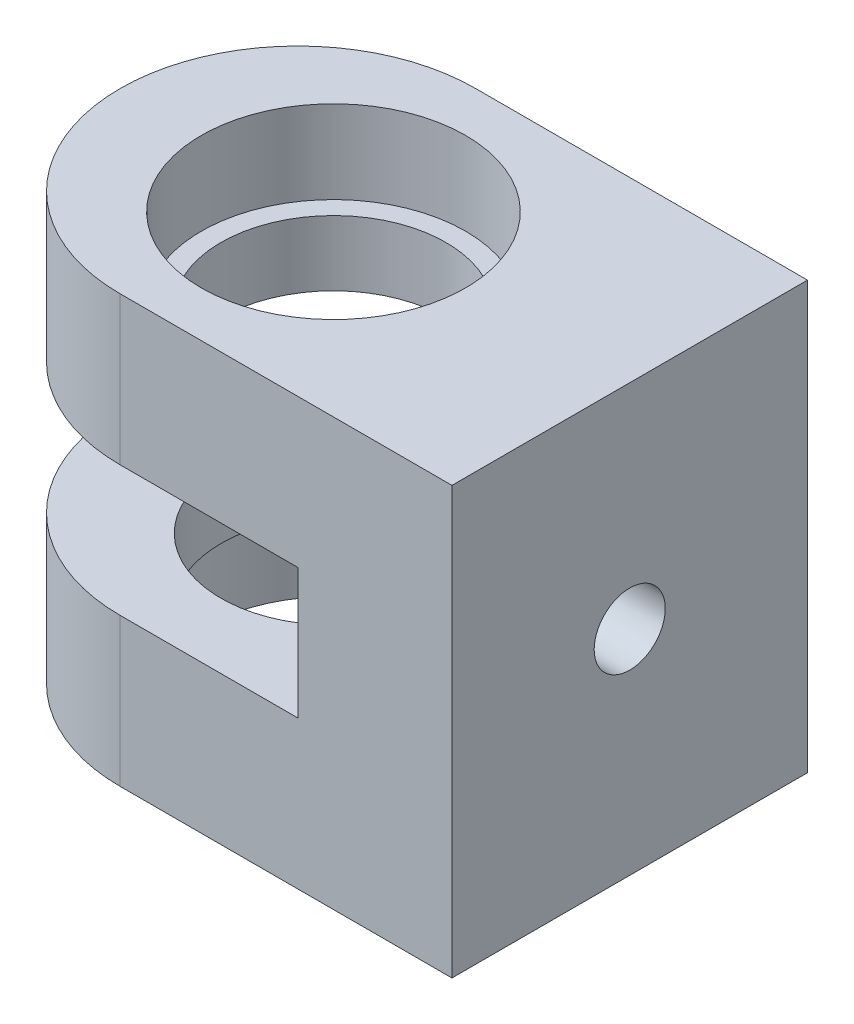
ISO-10303-21;
HEADER;
FILE_DESCRIPTION(('STEP AP214'),'2;1');
FILE_NAME('part.step','',(''),(''),'','','');
FILE_SCHEMA(('AUTOMOTIVE_DESIGN { 1 0 10303 214 1 1 1 1 }'));
ENDSEC;
DATA;
#1=APPLICATION_CONTEXT('core data for automotive mechanical design processes');
#2=APPLICATION_PROTOCOL_DEFINITION('international standard','automotive_design',2000,#1);
#3=PRODUCT_CONTEXT('',#1,'mechanical');
#4=PRODUCT('Part','Part','',(#3));
#5=PRODUCT_RELATED_PRODUCT_CATEGORY('part','',(#4));
#6=PRODUCT_DEFINITION_FORMATION('','',#4);
#7=PRODUCT_DEFINITION_CONTEXT('part definition',#1,'design');
#8=PRODUCT_DEFINITION('design','',#6,#7);
#9=PRODUCT_DEFINITION_SHAPE('','',#8);
#10=(LENGTH_UNIT() NAMED_UNIT(*) SI_UNIT(.MILLI.,.METRE.));
#11=(NAMED_UNIT(*) PLANE_ANGLE_UNIT() SI_UNIT($,.RADIAN.));
#12=(NAMED_UNIT(*) SI_UNIT($,.STERADIAN.) SOLID_ANGLE_UNIT());
#13=UNCERTAINTY_MEASURE_WITH_UNIT(LENGTH_MEASURE(1.E-05),#10,'distance_accuracy_value','');
#14=(GEOMETRIC_REPRESENTATION_CONTEXT(3) GLOBAL_UNCERTAINTY_ASSIGNED_CONTEXT((#13)) GLOBAL_UNIT_ASSIGNED_CONTEXT((#10,
#11,#12)) REPRESENTATION_CONTEXT('',''));
#15=CARTESIAN_POINT('',(0.,0.,0.));
#16=DIRECTION('',(0.,0.,1.));
#17=DIRECTION('',(1.,0.,0.));
#18=AXIS2_PLACEMENT_3D('',#15,#16,#17);
#19=CARTESIAN_POINT('',(21.5,36.,15.));
#20=DIRECTION('',(0.,0.,-1.));
#21=DIRECTION('',(-1.,0.,0.));
#22=AXIS2_PLACEMENT_3D('',#19,#20,#21);
#23=PLANE('',#22);
#24=DIRECTION('',(-1.,0.,0.));
#25=VECTOR('',#24,1.);
#26=CARTESIAN_POINT('',(8.5,12.5,15.));
#27=LINE('',#26,#25);
#28=CARTESIAN_POINT('',(8.5,12.5,15.));
#29=VERTEX_POINT('',#28);
#30=CARTESIAN_POINT('',(-6.5,12.5,15.));
#31=VERTEX_POINT('',#30);
#32=EDGE_CURVE('E251',#29,#31,#27,.T.);
#33=ORIENTED_EDGE('',*,*,#32,.T.);
#34=DIRECTION('',(0.,-1.,0.));
#35=VECTOR('',#34,1.);
#36=CARTESIAN_POINT('',(-6.5,36.,15.));
#37=LINE('',#36,#35);
#38=CARTESIAN_POINT('',(-6.5,0.,15.));
#39=VERTEX_POINT('',#38);
#40=EDGE_CURVE('E292',#31,#39,#37,.T.);
#41=ORIENTED_EDGE('',*,*,#40,.T.);
#42=DIRECTION('',(1.,0.,0.));
#43=VECTOR('',#42,1.);
#44=CARTESIAN_POINT('',(21.5,0.,15.));
#45=LINE('',#44,#43);
#46=CARTESIAN_POINT('',(21.5,0.,15.));
#47=VERTEX_POINT('',#46);
#48=EDGE_CURVE('E248',#39,#47,#45,.T.);
#49=ORIENTED_EDGE('',*,*,#48,.T.);
#50=DIRECTION('',(0.,-1.,0.));
#51=VECTOR('',#50,1.);
#52=CARTESIAN_POINT('',(21.5,36.,15.));
#53=LINE('',#52,#51);
#54=CARTESIAN_POINT('',(21.5,36.,15.));
#55=VERTEX_POINT('',#54);
#56=EDGE_CURVE('E271',#55,#47,#53,.T.);
#57=ORIENTED_EDGE('',*,*,#56,.F.);
#58=DIRECTION('',(1.,0.,0.));
#59=VECTOR('',#58,1.);
#60=CARTESIAN_POINT('',(21.5,36.,15.));
#61=LINE('',#60,#59);
#62=CARTESIAN_POINT('',(-6.5,36.,15.));
#63=VERTEX_POINT('',#62);
#64=EDGE_CURVE('E256',#63,#55,#61,.T.);
#65=ORIENTED_EDGE('',*,*,#64,.F.);
#66=DIRECTION('',(0.,-1.,0.));
#67=VECTOR('',#66,1.);
#68=CARTESIAN_POINT('',(-6.5,36.,15.));
#69=LINE('',#68,#67);
#70=CARTESIAN_POINT('',(-6.5,23.5,15.));
#71=VERTEX_POINT('',#70);
#72=EDGE_CURVE('E289',#63,#71,#69,.T.);
#73=ORIENTED_EDGE('',*,*,#72,.T.);
#74=DIRECTION('',(-1.,0.,0.));
#75=VECTOR('',#74,1.);
#76=CARTESIAN_POINT('',(8.5,23.5,15.));
#77=LINE('',#76,#75);
#78=CARTESIAN_POINT('',(8.5,23.5,15.));
#79=VERTEX_POINT('',#78);
#80=EDGE_CURVE('E249',#79,#71,#77,.T.);
#81=ORIENTED_EDGE('',*,*,#80,.F.);
#82=DIRECTION('',(0.,1.,0.));
#83=VECTOR('',#82,1.);
#84=CARTESIAN_POINT('',(8.5,12.5,15.));
#85=LINE('',#84,#83);
#86=EDGE_CURVE('E240',#29,#79,#85,.T.);
#87=ORIENTED_EDGE('',*,*,#86,.F.);
#88=EDGE_LOOP('',(#33,#41,#49,#57,#65,#73,#81,#87));
#89=FACE_BOUND('',#88,.T.);
#90=ADVANCED_FACE('F36',(#89),#23,.F.);
#91=CARTESIAN_POINT('',(21.5,36.,15.));
#92=DIRECTION('',(-1.,0.,0.));
#93=DIRECTION('',(0.,0.,1.));
#94=AXIS2_PLACEMENT_3D('',#91,#92,#93);
#95=PLANE('',#94);
#96=CARTESIAN_POINT('',(21.5,18.,0.));
#97=DIRECTION('',(-1.,0.,0.));
#98=DIRECTION('',(0.,0.,1.));
#99=AXIS2_PLACEMENT_3D('',#96,#97,#98);
#100=CIRCLE('',#99,3.);
#101=CARTESIAN_POINT('',(21.5,18.,3.));
#102=VERTEX_POINT('',#101);
#103=EDGE_CURVE('E193',#102,#102,#100,.T.);
#104=ORIENTED_EDGE('',*,*,#103,.T.);
#105=EDGE_LOOP('',(#104));
#106=FACE_BOUND('',#105,.T.);
#107=DIRECTION('',(0.,0.,-1.));
#108=VECTOR('',#107,1.);
#109=CARTESIAN_POINT('',(21.5,0.,15.));
#110=LINE('',#109,#108);
#111=CARTESIAN_POINT('',(21.5,0.,-15.));
#112=VERTEX_POINT('',#111);
#113=EDGE_CURVE('E265',#47,#112,#110,.T.);
#114=ORIENTED_EDGE('',*,*,#113,.T.);
#115=DIRECTION('',(0.,-1.,0.));
#116=VECTOR('',#115,1.);
#117=CARTESIAN_POINT('',(21.5,36.,-15.));
#118=LINE('',#117,#116);
#119=CARTESIAN_POINT('',(21.5,36.,-15.));
#120=VERTEX_POINT('',#119);
#121=EDGE_CURVE('E263',#120,#112,#118,.T.);
#122=ORIENTED_EDGE('',*,*,#121,.F.);
#123=DIRECTION('',(0.,0.,-1.));
#124=VECTOR('',#123,1.);
#125=CARTESIAN_POINT('',(21.5,36.,15.));
#126=LINE('',#125,#124);
#127=EDGE_CURVE('E258',#55,#120,#126,.T.);
#128=ORIENTED_EDGE('',*,*,#127,.F.);
#129=ORIENTED_EDGE('',*,*,#56,.T.);
#130=EDGE_LOOP('',(#114,#122,#128,#129));
#131=FACE_BOUND('',#130,.T.);
#132=ADVANCED_FACE('F329',(#106,#131),#95,.F.);
#133=CARTESIAN_POINT('',(21.5,36.,-15.));
#134=DIRECTION('',(0.,0.,1.));
#135=DIRECTION('',(1.,0.,0.));
#136=AXIS2_PLACEMENT_3D('',#133,#134,#135);
#137=PLANE('',#136);
#138=DIRECTION('',(-1.,0.,0.));
#139=VECTOR('',#138,1.);
#140=CARTESIAN_POINT('',(21.5,0.,-15.));
#141=LINE('',#140,#139);
#142=CARTESIAN_POINT('',(-6.5,0.,-15.));
#143=VERTEX_POINT('',#142);
#144=EDGE_CURVE('E259',#112,#143,#141,.T.);
#145=ORIENTED_EDGE('',*,*,#144,.T.);
#146=DIRECTION('',(0.,-1.,0.));
#147=VECTOR('',#146,1.);
#148=CARTESIAN_POINT('',(-6.5,36.,-15.));
#149=LINE('',#148,#147);
#150=CARTESIAN_POINT('',(-6.5,12.5,-15.));
#151=VERTEX_POINT('',#150);
#152=EDGE_CURVE('E282',#143,#151,#149,.F.);
#153=ORIENTED_EDGE('',*,*,#152,.T.);
#154=DIRECTION('',(-1.,0.,0.));
#155=VECTOR('',#154,1.);
#156=CARTESIAN_POINT('',(8.5,12.5,-15.));
#157=LINE('',#156,#155);
#158=CARTESIAN_POINT('',(8.5,12.5,-15.));
#159=VERTEX_POINT('',#158);
#160=EDGE_CURVE('E244',#159,#151,#157,.T.);
#161=ORIENTED_EDGE('',*,*,#160,.F.);
#162=DIRECTION('',(0.,-1.,0.));
#163=VECTOR('',#162,1.);
#164=CARTESIAN_POINT('',(8.5,12.5,-15.));
#165=LINE('',#164,#163);
#166=CARTESIAN_POINT('',(8.5,23.5,-15.));
#167=VERTEX_POINT('',#166);
#168=EDGE_CURVE('E232',#167,#159,#165,.T.);
#169=ORIENTED_EDGE('',*,*,#168,.F.);
#170=DIRECTION('',(-1.,0.,0.));
#171=VECTOR('',#170,1.);
#172=CARTESIAN_POINT('',(8.5,23.5,-15.));
#173=LINE('',#172,#171);
#174=CARTESIAN_POINT('',(-6.5,23.5,-15.));
#175=VERTEX_POINT('',#174);
#176=EDGE_CURVE('E245',#167,#175,#173,.T.);
#177=ORIENTED_EDGE('',*,*,#176,.T.);
#178=DIRECTION('',(0.,-1.,0.));
#179=VECTOR('',#178,1.);
#180=CARTESIAN_POINT('',(-6.5,36.,-15.));
#181=LINE('',#180,#179);
#182=CARTESIAN_POINT('',(-6.5,36.,-15.));
#183=VERTEX_POINT('',#182);
#184=EDGE_CURVE('E280',#175,#183,#181,.F.);
#185=ORIENTED_EDGE('',*,*,#184,.T.);
#186=DIRECTION('',(-1.,0.,0.));
#187=VECTOR('',#186,1.);
#188=CARTESIAN_POINT('',(21.5,36.,-15.));
#189=LINE('',#188,#187);
#190=EDGE_CURVE('E261',#120,#183,#189,.T.);
#191=ORIENTED_EDGE('',*,*,#190,.F.);
#192=ORIENTED_EDGE('',*,*,#121,.T.);
#193=EDGE_LOOP('',(#145,#153,#161,#169,#177,#185,#191,#192));
#194=FACE_BOUND('',#193,.T.);
#195=ADVANCED_FACE('F315',(#194),#137,.F.);
#196=CARTESIAN_POINT('',(0.,36.,0.));
#197=DIRECTION('',(0.,1.,0.));
#198=DIRECTION('',(0.,0.,1.));
#199=AXIS2_PLACEMENT_3D('',#196,#197,#198);
#200=PLANE('',#199);
#201=CARTESIAN_POINT('',(-3.5,36.,0.));
#202=DIRECTION('',(0.,1.,0.));
#203=DIRECTION('',(0.,0.,1.));
#204=AXIS2_PLACEMENT_3D('',#201,#202,#203);
#205=CIRCLE('',#204,11.15);
#206=CARTESIAN_POINT('',(-3.5,36.,11.15));
#207=VERTEX_POINT('',#206);
#208=EDGE_CURVE('E226',#207,#207,#205,.T.);
#209=ORIENTED_EDGE('',*,*,#208,.F.);
#210=EDGE_LOOP('',(#209));
#211=FACE_BOUND('',#210,.T.);
#212=CARTESIAN_POINT('',(-6.5,36.,0.));
#213=DIRECTION('',(0.,1.,0.));
#214=DIRECTION('',(0.,0.,1.));
#215=AXIS2_PLACEMENT_3D('',#212,#213,#214);
#216=CIRCLE('',#215,15.);
#217=CARTESIAN_POINT('',(-21.5,36.,0.));
#218=VERTEX_POINT('',#217);
#219=EDGE_CURVE('E45',#183,#218,#216,.T.);
#220=ORIENTED_EDGE('',*,*,#219,.T.);
#221=CARTESIAN_POINT('',(-6.5,36.,0.));
#222=DIRECTION('',(0.,1.,0.));
#223=DIRECTION('',(0.,0.,1.));
#224=AXIS2_PLACEMENT_3D('',#221,#222,#223);
#225=CIRCLE('',#224,15.);
#226=EDGE_CURVE('E11',#218,#63,#225,.T.);
#227=ORIENTED_EDGE('',*,*,#226,.T.);
#228=ORIENTED_EDGE('',*,*,#64,.T.);
#229=ORIENTED_EDGE('',*,*,#127,.T.);
#230=ORIENTED_EDGE('',*,*,#190,.T.);
#231=EDGE_LOOP('',(#220,#227,#228,#229,#230));
#232=FACE_BOUND('',#231,.T.);
#233=ADVANCED_FACE('F326',(#211,#232),#200,.T.);
#234=CARTESIAN_POINT('',(0.,0.,0.));
#235=DIRECTION('',(0.,1.,0.));
#236=DIRECTION('',(0.,0.,1.));
#237=AXIS2_PLACEMENT_3D('',#234,#235,#236);
#238=PLANE('',#237);
#239=CARTESIAN_POINT('',(-3.5,0.,0.));
#240=DIRECTION('',(0.,-1.,0.));
#241=DIRECTION('',(0.,0.,-1.));
#242=AXIS2_PLACEMENT_3D('',#239,#240,#241);
#243=CIRCLE('',#242,11.15);
#244=CARTESIAN_POINT('',(-3.5,0.,-11.15));
#245=VERTEX_POINT('',#244);
#246=EDGE_CURVE('E222',#245,#245,#243,.T.);
#247=ORIENTED_EDGE('',*,*,#246,.F.);
#248=EDGE_LOOP('',(#247));
#249=FACE_BOUND('',#248,.T.);
#250=CARTESIAN_POINT('',(-6.5,0.,0.));
#251=DIRECTION('',(0.,1.,0.));
#252=DIRECTION('',(0.,0.,1.));
#253=AXIS2_PLACEMENT_3D('',#250,#251,#252);
#254=CIRCLE('',#253,15.);
#255=CARTESIAN_POINT('',(-21.5,0.,0.));
#256=VERTEX_POINT('',#255);
#257=EDGE_CURVE('E274',#39,#256,#254,.F.);
#258=ORIENTED_EDGE('',*,*,#257,.T.);
#259=CARTESIAN_POINT('',(-6.5,0.,0.));
#260=DIRECTION('',(0.,1.,0.));
#261=DIRECTION('',(0.,0.,1.));
#262=AXIS2_PLACEMENT_3D('',#259,#260,#261);
#263=CIRCLE('',#262,15.);
#264=EDGE_CURVE('E278',#256,#143,#263,.F.);
#265=ORIENTED_EDGE('',*,*,#264,.T.);
#266=ORIENTED_EDGE('',*,*,#144,.F.);
#267=ORIENTED_EDGE('',*,*,#113,.F.);
#268=ORIENTED_EDGE('',*,*,#48,.F.);
#269=EDGE_LOOP('',(#258,#265,#266,#267,#268));
#270=FACE_BOUND('',#269,.T.);
#271=ADVANCED_FACE('F334',(#249,#270),#238,.F.);
#272=CARTESIAN_POINT('',(8.5,23.5,15.));
#273=DIRECTION('',(0.,1.,0.));
#274=DIRECTION('',(0.,0.,1.));
#275=AXIS2_PLACEMENT_3D('',#272,#273,#274);
#276=PLANE('',#275);
#277=CARTESIAN_POINT('',(-3.5,23.5,0.));
#278=DIRECTION('',(0.,1.,0.));
#279=DIRECTION('',(0.,0.,1.));
#280=AXIS2_PLACEMENT_3D('',#277,#278,#279);
#281=CIRCLE('',#280,9.5);
#282=CARTESIAN_POINT('',(-3.5,23.5,9.5));
#283=VERTEX_POINT('',#282);
#284=EDGE_CURVE('E219',#283,#283,#281,.T.);
#285=ORIENTED_EDGE('',*,*,#284,.T.);
#286=EDGE_LOOP('',(#285));
#287=FACE_BOUND('',#286,.T.);
#288=ORIENTED_EDGE('',*,*,#80,.T.);
#289=CARTESIAN_POINT('',(-6.5,23.5,0.));
#290=DIRECTION('',(0.,1.,0.));
#291=DIRECTION('',(0.,0.,1.));
#292=AXIS2_PLACEMENT_3D('',#289,#290,#291);
#293=CIRCLE('',#292,15.);
#294=CARTESIAN_POINT('',(-21.5,23.5,0.));
#295=VERTEX_POINT('',#294);
#296=EDGE_CURVE('E59',#71,#295,#293,.F.);
#297=ORIENTED_EDGE('',*,*,#296,.T.);
#298=CARTESIAN_POINT('',(-6.5,23.5,0.));
#299=DIRECTION('',(0.,1.,0.));
#300=DIRECTION('',(0.,0.,1.));
#301=AXIS2_PLACEMENT_3D('',#298,#299,#300);
#302=CIRCLE('',#301,15.);
#303=EDGE_CURVE('E294',#295,#175,#302,.F.);
#304=ORIENTED_EDGE('',*,*,#303,.T.);
#305=ORIENTED_EDGE('',*,*,#176,.F.);
#306=DIRECTION('',(0.,0.,-1.));
#307=VECTOR('',#306,1.);
#308=CARTESIAN_POINT('',(8.5,23.5,15.));
#309=LINE('',#308,#307);
#310=EDGE_CURVE('E242',#79,#167,#309,.T.);
#311=ORIENTED_EDGE('',*,*,#310,.F.);
#312=EDGE_LOOP('',(#288,#297,#304,#305,#311));
#313=FACE_BOUND('',#312,.T.);
#314=ADVANCED_FACE('F311',(#287,#313),#276,.F.);
#315=CARTESIAN_POINT('',(8.5,12.5,15.));
#316=DIRECTION('',(0.,-1.,0.));
#317=DIRECTION('',(0.,0.,-1.));
#318=AXIS2_PLACEMENT_3D('',#315,#316,#317);
#319=PLANE('',#318);
#320=CARTESIAN_POINT('',(-3.5,12.5,0.));
#321=DIRECTION('',(0.,-1.,0.));
#322=DIRECTION('',(0.,0.,-1.));
#323=AXIS2_PLACEMENT_3D('',#320,#321,#322);
#324=CIRCLE('',#323,9.5);
#325=CARTESIAN_POINT('',(-3.5,12.5,-9.5));
#326=VERTEX_POINT('',#325);
#327=EDGE_CURVE('E216',#326,#326,#324,.T.);
#328=ORIENTED_EDGE('',*,*,#327,.T.);
#329=EDGE_LOOP('',(#328));
#330=FACE_BOUND('',#329,.T.);
#331=ORIENTED_EDGE('',*,*,#160,.T.);
#332=CARTESIAN_POINT('',(-6.5,12.5,0.));
#333=DIRECTION('',(0.,-1.,0.));
#334=DIRECTION('',(0.,0.,-1.));
#335=AXIS2_PLACEMENT_3D('',#332,#333,#334);
#336=CIRCLE('',#335,15.);
#337=CARTESIAN_POINT('',(-21.5,12.5,0.));
#338=VERTEX_POINT('',#337);
#339=EDGE_CURVE('E287',#151,#338,#336,.F.);
#340=ORIENTED_EDGE('',*,*,#339,.T.);
#341=CARTESIAN_POINT('',(-6.5,12.5,0.));
#342=DIRECTION('',(0.,-1.,0.));
#343=DIRECTION('',(0.,0.,-1.));
#344=AXIS2_PLACEMENT_3D('',#341,#342,#343);
#345=CIRCLE('',#344,15.);
#346=EDGE_CURVE('E285',#338,#31,#345,.F.);
#347=ORIENTED_EDGE('',*,*,#346,.T.);
#348=ORIENTED_EDGE('',*,*,#32,.F.);
#349=DIRECTION('',(0.,0.,1.));
#350=VECTOR('',#349,1.);
#351=CARTESIAN_POINT('',(8.5,12.5,15.));
#352=LINE('',#351,#350);
#353=EDGE_CURVE('E237',#159,#29,#352,.T.);
#354=ORIENTED_EDGE('',*,*,#353,.F.);
#355=EDGE_LOOP('',(#331,#340,#347,#348,#354));
#356=FACE_BOUND('',#355,.T.);
#357=ADVANCED_FACE('F339',(#330,#356),#319,.F.);
#358=CARTESIAN_POINT('',(8.5,0.,0.));
#359=DIRECTION('',(-1.,0.,0.));
#360=DIRECTION('',(0.,0.,1.));
#361=AXIS2_PLACEMENT_3D('',#358,#359,#360);
#362=PLANE('',#361);
#363=DIRECTION('',(0.,0.,-1.));
#364=VECTOR('',#363,1.);
#365=CARTESIAN_POINT('',(8.5,23.1961524227066,3.));
#366=LINE('',#365,#364);
#367=CARTESIAN_POINT('',(8.5,23.1961524227066,3.));
#368=VERTEX_POINT('',#367);
#369=CARTESIAN_POINT('',(8.5,23.1961524227066,-3.));
#370=VERTEX_POINT('',#369);
#371=EDGE_CURVE('E157',#368,#370,#366,.T.);
#372=ORIENTED_EDGE('',*,*,#371,.F.);
#373=DIRECTION('',(0.,0.866025403784439,-0.5));
#374=VECTOR('',#373,1.);
#375=CARTESIAN_POINT('',(8.5,18.,6.));
#376=LINE('',#375,#374);
#377=CARTESIAN_POINT('',(8.5,18.,6.));
#378=VERTEX_POINT('',#377);
#379=EDGE_CURVE('E175',#378,#368,#376,.T.);
#380=ORIENTED_EDGE('',*,*,#379,.F.);
#381=DIRECTION('',(0.,0.866025403784439,0.5));
#382=VECTOR('',#381,1.);
#383=CARTESIAN_POINT('',(8.5,12.8038475772934,3.));
#384=LINE('',#383,#382);
#385=CARTESIAN_POINT('',(8.5,12.8038475772934,3.));
#386=VERTEX_POINT('',#385);
#387=EDGE_CURVE('E178',#386,#378,#384,.T.);
#388=ORIENTED_EDGE('',*,*,#387,.F.);
#389=DIRECTION('',(0.,0.,1.));
#390=VECTOR('',#389,1.);
#391=CARTESIAN_POINT('',(8.5,12.8038475772934,-3.));
#392=LINE('',#391,#390);
#393=CARTESIAN_POINT('',(8.5,12.8038475772934,-3.));
#394=VERTEX_POINT('',#393);
#395=EDGE_CURVE('E198',#394,#386,#392,.T.);
#396=ORIENTED_EDGE('',*,*,#395,.F.);
#397=DIRECTION('',(0.,-0.866025403784439,0.5));
#398=VECTOR('',#397,1.);
#399=CARTESIAN_POINT('',(8.5,18.,-6.));
#400=LINE('',#399,#398);
#401=CARTESIAN_POINT('',(8.5,18.,-6.));
#402=VERTEX_POINT('',#401);
#403=EDGE_CURVE('E195',#402,#394,#400,.T.);
#404=ORIENTED_EDGE('',*,*,#403,.F.);
#405=DIRECTION('',(0.,-0.866025403784439,-0.5));
#406=VECTOR('',#405,1.);
#407=CARTESIAN_POINT('',(8.5,23.1961524227066,-3.));
#408=LINE('',#407,#406);
#409=EDGE_CURVE('E192',#370,#402,#408,.T.);
#410=ORIENTED_EDGE('',*,*,#409,.F.);
#411=EDGE_LOOP('',(#372,#380,#388,#396,#404,#410));
#412=FACE_BOUND('',#411,.T.);
#413=ORIENTED_EDGE('',*,*,#168,.T.);
#414=ORIENTED_EDGE('',*,*,#353,.T.);
#415=ORIENTED_EDGE('',*,*,#86,.T.);
#416=ORIENTED_EDGE('',*,*,#310,.T.);
#417=EDGE_LOOP('',(#413,#414,#415,#416));
#418=FACE_BOUND('',#417,.T.);
#419=ADVANCED_FACE('F319',(#412,#418),#362,.T.);
#420=CARTESIAN_POINT('',(-3.5,29.,0.));
#421=DIRECTION('',(0.,1.,0.));
#422=DIRECTION('',(0.,0.,1.));
#423=AXIS2_PLACEMENT_3D('',#420,#421,#422);
#424=CYLINDRICAL_SURFACE('',#423,11.15);
#425=CARTESIAN_POINT('',(-3.5,29.,0.));
#426=DIRECTION('',(0.,1.,0.));
#427=DIRECTION('',(0.,0.,1.));
#428=AXIS2_PLACEMENT_3D('',#425,#426,#427);
#429=CIRCLE('',#428,11.15);
#430=CARTESIAN_POINT('',(-3.5,29.,11.15));
#431=VERTEX_POINT('',#430);
#432=EDGE_CURVE('E229',#431,#431,#429,.T.);
#433=ORIENTED_EDGE('',*,*,#432,.F.);
#434=EDGE_LOOP('',(#433));
#435=FACE_BOUND('',#434,.T.);
#436=ORIENTED_EDGE('',*,*,#208,.T.);
#437=EDGE_LOOP('',(#436));
#438=FACE_BOUND('',#437,.T.);
#439=ADVANCED_FACE('F378',(#435,#438),#424,.F.);
#440=CARTESIAN_POINT('',(-3.5,29.,0.));
#441=DIRECTION('',(0.,1.,0.));
#442=DIRECTION('',(0.,0.,1.));
#443=AXIS2_PLACEMENT_3D('',#440,#441,#442);
#444=PLANE('',#443);
#445=CARTESIAN_POINT('',(-3.5,29.,0.));
#446=DIRECTION('',(0.,1.,0.));
#447=DIRECTION('',(0.,0.,1.));
#448=AXIS2_PLACEMENT_3D('',#445,#446,#447);
#449=CIRCLE('',#448,9.5);
#450=CARTESIAN_POINT('',(-3.5,29.,9.5));
#451=VERTEX_POINT('',#450);
#452=EDGE_CURVE('E205',#451,#451,#449,.T.);
#453=ORIENTED_EDGE('',*,*,#452,.F.);
#454=EDGE_LOOP('',(#453));
#455=FACE_BOUND('',#454,.T.);
#456=ORIENTED_EDGE('',*,*,#432,.T.);
#457=EDGE_LOOP('',(#456));
#458=FACE_BOUND('',#457,.T.);
#459=ADVANCED_FACE('F382',(#455,#458),#444,.T.);
#460=CARTESIAN_POINT('',(-3.5,7.,0.));
#461=DIRECTION('',(0.,-1.,0.));
#462=DIRECTION('',(0.,0.,-1.));
#463=AXIS2_PLACEMENT_3D('',#460,#461,#462);
#464=CYLINDRICAL_SURFACE('',#463,11.15);
#465=CARTESIAN_POINT('',(-3.5,7.,0.));
#466=DIRECTION('',(0.,-1.,0.));
#467=DIRECTION('',(0.,0.,-1.));
#468=AXIS2_PLACEMENT_3D('',#465,#466,#467);
#469=CIRCLE('',#468,11.15);
#470=CARTESIAN_POINT('',(-3.5,7.,-11.15));
#471=VERTEX_POINT('',#470);
#472=EDGE_CURVE('E223',#471,#471,#469,.T.);
#473=ORIENTED_EDGE('',*,*,#472,.F.);
#474=EDGE_LOOP('',(#473));
#475=FACE_BOUND('',#474,.T.);
#476=ORIENTED_EDGE('',*,*,#246,.T.);
#477=EDGE_LOOP('',(#476));
#478=FACE_BOUND('',#477,.T.);
#479=ADVANCED_FACE('F386',(#475,#478),#464,.F.);
#480=CARTESIAN_POINT('',(-3.5,7.,0.));
#481=DIRECTION('',(0.,-1.,0.));
#482=DIRECTION('',(0.,0.,-1.));
#483=AXIS2_PLACEMENT_3D('',#480,#481,#482);
#484=PLANE('',#483);
#485=CARTESIAN_POINT('',(-3.5,7.,0.));
#486=DIRECTION('',(0.,-1.,0.));
#487=DIRECTION('',(0.,0.,-1.));
#488=AXIS2_PLACEMENT_3D('',#485,#486,#487);
#489=CIRCLE('',#488,9.5);
#490=CARTESIAN_POINT('',(-3.5,7.,-9.5));
#491=VERTEX_POINT('',#490);
#492=EDGE_CURVE('E215',#491,#491,#489,.T.);
#493=ORIENTED_EDGE('',*,*,#492,.F.);
#494=EDGE_LOOP('',(#493));
#495=FACE_BOUND('',#494,.T.);
#496=ORIENTED_EDGE('',*,*,#472,.T.);
#497=EDGE_LOOP('',(#496));
#498=FACE_BOUND('',#497,.T.);
#499=ADVANCED_FACE('F390',(#495,#498),#484,.T.);
#500=CARTESIAN_POINT('',(-3.5,0.,0.));
#501=DIRECTION('',(0.,1.,0.));
#502=DIRECTION('',(0.,0.,1.));
#503=AXIS2_PLACEMENT_3D('',#500,#501,#502);
#504=CYLINDRICAL_SURFACE('',#503,9.5);
#505=ORIENTED_EDGE('',*,*,#492,.T.);
#506=EDGE_LOOP('',(#505));
#507=FACE_BOUND('',#506,.T.);
#508=ORIENTED_EDGE('',*,*,#327,.F.);
#509=EDGE_LOOP('',(#508));
#510=FACE_BOUND('',#509,.T.);
#511=ADVANCED_FACE('F394',(#507,#510),#504,.F.);
#512=ORIENTED_EDGE('',*,*,#452,.T.);
#513=EDGE_LOOP('',(#512));
#514=FACE_BOUND('',#513,.T.);
#515=ORIENTED_EDGE('',*,*,#284,.F.);
#516=EDGE_LOOP('',(#515));
#517=FACE_BOUND('',#516,.T.);
#518=ADVANCED_FACE('F396',(#514,#517),#504,.F.);
#519=CARTESIAN_POINT('',(13.5,23.1961524227066,3.));
#520=DIRECTION('',(0.,1.,0.));
#521=DIRECTION('',(0.,0.,1.));
#522=AXIS2_PLACEMENT_3D('',#519,#520,#521);
#523=PLANE('',#522);
#524=ORIENTED_EDGE('',*,*,#371,.T.);
#525=DIRECTION('',(-1.,0.,0.));
#526=VECTOR('',#525,1.);
#527=CARTESIAN_POINT('',(13.5,23.1961524227066,-3.));
#528=LINE('',#527,#526);
#529=CARTESIAN_POINT('',(13.5,23.1961524227066,-3.));
#530=VERTEX_POINT('',#529);
#531=EDGE_CURVE('E150',#530,#370,#528,.T.);
#532=ORIENTED_EDGE('',*,*,#531,.F.);
#533=DIRECTION('',(0.,0.,-1.));
#534=VECTOR('',#533,1.);
#535=CARTESIAN_POINT('',(13.5,23.1961524227066,3.));
#536=LINE('',#535,#534);
#537=CARTESIAN_POINT('',(13.5,23.1961524227066,3.));
#538=VERTEX_POINT('',#537);
#539=EDGE_CURVE('E154',#538,#530,#536,.T.);
#540=ORIENTED_EDGE('',*,*,#539,.F.);
#541=DIRECTION('',(-1.,0.,0.));
#542=VECTOR('',#541,1.);
#543=CARTESIAN_POINT('',(13.5,23.1961524227066,3.));
#544=LINE('',#543,#542);
#545=EDGE_CURVE('E203',#538,#368,#544,.T.);
#546=ORIENTED_EDGE('',*,*,#545,.T.);
#547=EDGE_LOOP('',(#524,#532,#540,#546));
#548=FACE_BOUND('',#547,.T.);
#549=ADVANCED_FACE('F152',(#548),#523,.F.);
#550=CARTESIAN_POINT('',(13.5,18.,6.));
#551=DIRECTION('',(0.,0.5,0.866025403784439));
#552=DIRECTION('',(0.,-0.866025403784439,0.5));
#553=AXIS2_PLACEMENT_3D('',#550,#551,#552);
#554=PLANE('',#553);
#555=ORIENTED_EDGE('',*,*,#379,.T.);
#556=ORIENTED_EDGE('',*,*,#545,.F.);
#557=DIRECTION('',(0.,0.866025403784439,-0.5));
#558=VECTOR('',#557,1.);
#559=CARTESIAN_POINT('',(13.5,18.,6.));
#560=LINE('',#559,#558);
#561=CARTESIAN_POINT('',(13.5,18.,6.));
#562=VERTEX_POINT('',#561);
#563=EDGE_CURVE('E162',#562,#538,#560,.T.);
#564=ORIENTED_EDGE('',*,*,#563,.F.);
#565=DIRECTION('',(-1.,0.,0.));
#566=VECTOR('',#565,1.);
#567=CARTESIAN_POINT('',(13.5,18.,6.));
#568=LINE('',#567,#566);
#569=EDGE_CURVE('E206',#562,#378,#568,.T.);
#570=ORIENTED_EDGE('',*,*,#569,.T.);
#571=EDGE_LOOP('',(#555,#556,#564,#570));
#572=FACE_BOUND('',#571,.T.);
#573=ADVANCED_FACE('F402',(#572),#554,.F.);
#574=CARTESIAN_POINT('',(13.5,12.8038475772934,3.));
#575=DIRECTION('',(0.,-0.5,0.866025403784438));
#576=DIRECTION('',(0.,-0.866025403784439,-0.5));
#577=AXIS2_PLACEMENT_3D('',#574,#575,#576);
#578=PLANE('',#577);
#579=ORIENTED_EDGE('',*,*,#387,.T.);
#580=ORIENTED_EDGE('',*,*,#569,.F.);
#581=DIRECTION('',(0.,0.866025403784439,0.5));
#582=VECTOR('',#581,1.);
#583=CARTESIAN_POINT('',(13.5,12.8038475772934,3.));
#584=LINE('',#583,#582);
#585=CARTESIAN_POINT('',(13.5,12.8038475772934,3.));
#586=VERTEX_POINT('',#585);
#587=EDGE_CURVE('E188',#586,#562,#584,.T.);
#588=ORIENTED_EDGE('',*,*,#587,.F.);
#589=DIRECTION('',(-1.,0.,0.));
#590=VECTOR('',#589,1.);
#591=CARTESIAN_POINT('',(13.5,12.8038475772934,3.));
#592=LINE('',#591,#590);
#593=EDGE_CURVE('E208',#586,#386,#592,.T.);
#594=ORIENTED_EDGE('',*,*,#593,.T.);
#595=EDGE_LOOP('',(#579,#580,#588,#594));
#596=FACE_BOUND('',#595,.T.);
#597=ADVANCED_FACE('F412',(#596),#578,.F.);
#598=CARTESIAN_POINT('',(13.5,12.8038475772934,-3.));
#599=DIRECTION('',(0.,-1.,0.));
#600=DIRECTION('',(0.,0.,-1.));
#601=AXIS2_PLACEMENT_3D('',#598,#599,#600);
#602=PLANE('',#601);
#603=ORIENTED_EDGE('',*,*,#395,.T.);
#604=ORIENTED_EDGE('',*,*,#593,.F.);
#605=DIRECTION('',(0.,0.,1.));
#606=VECTOR('',#605,1.);
#607=CARTESIAN_POINT('',(13.5,12.8038475772934,-3.));
#608=LINE('',#607,#606);
#609=CARTESIAN_POINT('',(13.5,12.8038475772934,-3.));
#610=VERTEX_POINT('',#609);
#611=EDGE_CURVE('E185',#610,#586,#608,.T.);
#612=ORIENTED_EDGE('',*,*,#611,.F.);
#613=DIRECTION('',(-1.,0.,0.));
#614=VECTOR('',#613,1.);
#615=CARTESIAN_POINT('',(13.5,12.8038475772934,-3.));
#616=LINE('',#615,#614);
#617=EDGE_CURVE('E210',#610,#394,#616,.T.);
#618=ORIENTED_EDGE('',*,*,#617,.T.);
#619=EDGE_LOOP('',(#603,#604,#612,#618));
#620=FACE_BOUND('',#619,.T.);
#621=ADVANCED_FACE('F408',(#620),#602,.F.);
#622=CARTESIAN_POINT('',(13.5,18.,-6.));
#623=DIRECTION('',(0.,-0.5,-0.866025403784439));
#624=DIRECTION('',(0.,0.866025403784439,-0.5));
#625=AXIS2_PLACEMENT_3D('',#622,#623,#624);
#626=PLANE('',#625);
#627=ORIENTED_EDGE('',*,*,#403,.T.);
#628=ORIENTED_EDGE('',*,*,#617,.F.);
#629=DIRECTION('',(0.,-0.866025403784439,0.5));
#630=VECTOR('',#629,1.);
#631=CARTESIAN_POINT('',(13.5,18.,-6.));
#632=LINE('',#631,#630);
#633=CARTESIAN_POINT('',(13.5,18.,-6.));
#634=VERTEX_POINT('',#633);
#635=EDGE_CURVE('E170',#634,#610,#632,.T.);
#636=ORIENTED_EDGE('',*,*,#635,.F.);
#637=DIRECTION('',(-1.,0.,0.));
#638=VECTOR('',#637,1.);
#639=CARTESIAN_POINT('',(13.5,18.,-6.));
#640=LINE('',#639,#638);
#641=EDGE_CURVE('E161',#634,#402,#640,.T.);
#642=ORIENTED_EDGE('',*,*,#641,.T.);
#643=EDGE_LOOP('',(#627,#628,#636,#642));
#644=FACE_BOUND('',#643,.T.);
#645=ADVANCED_FACE('F405',(#644),#626,.F.);
#646=CARTESIAN_POINT('',(13.5,23.1961524227066,-3.));
#647=DIRECTION('',(0.,0.5,-0.866025403784439));
#648=DIRECTION('',(0.,0.866025403784439,0.5));
#649=AXIS2_PLACEMENT_3D('',#646,#647,#648);
#650=PLANE('',#649);
#651=ORIENTED_EDGE('',*,*,#409,.T.);
#652=ORIENTED_EDGE('',*,*,#641,.F.);
#653=DIRECTION('',(0.,-0.866025403784439,-0.5));
#654=VECTOR('',#653,1.);
#655=CARTESIAN_POINT('',(13.5,23.1961524227066,-3.));
#656=LINE('',#655,#654);
#657=EDGE_CURVE('E165',#530,#634,#656,.T.);
#658=ORIENTED_EDGE('',*,*,#657,.F.);
#659=ORIENTED_EDGE('',*,*,#531,.T.);
#660=EDGE_LOOP('',(#651,#652,#658,#659));
#661=FACE_BOUND('',#660,.T.);
#662=ADVANCED_FACE('F166',(#661),#650,.F.);
#663=CARTESIAN_POINT('',(13.5,0.,0.));
#664=DIRECTION('',(-1.,0.,0.));
#665=DIRECTION('',(0.,0.,1.));
#666=AXIS2_PLACEMENT_3D('',#663,#664,#665);
#667=PLANE('',#666);
#668=CARTESIAN_POINT('',(13.5,18.,0.));
#669=DIRECTION('',(-1.,0.,0.));
#670=DIRECTION('',(0.,0.,1.));
#671=AXIS2_PLACEMENT_3D('',#668,#669,#670);
#672=CIRCLE('',#671,3.);
#673=CARTESIAN_POINT('',(13.5,18.,3.));
#674=VERTEX_POINT('',#673);
#675=EDGE_CURVE('E181',#674,#674,#672,.T.);
#676=ORIENTED_EDGE('',*,*,#675,.F.);
#677=EDGE_LOOP('',(#676));
#678=FACE_BOUND('',#677,.T.);
#679=ORIENTED_EDGE('',*,*,#539,.T.);
#680=ORIENTED_EDGE('',*,*,#657,.T.);
#681=ORIENTED_EDGE('',*,*,#635,.T.);
#682=ORIENTED_EDGE('',*,*,#611,.T.);
#683=ORIENTED_EDGE('',*,*,#587,.T.);
#684=ORIENTED_EDGE('',*,*,#563,.T.);
#685=EDGE_LOOP('',(#679,#680,#681,#682,#683,#684));
#686=FACE_BOUND('',#685,.T.);
#687=ADVANCED_FACE('F172',(#678,#686),#667,.T.);
#688=CARTESIAN_POINT('',(21.5,18.,0.));
#689=DIRECTION('',(-1.,0.,0.));
#690=DIRECTION('',(0.,0.,1.));
#691=AXIS2_PLACEMENT_3D('',#688,#689,#690);
#692=CYLINDRICAL_SURFACE('',#691,3.);
#693=ORIENTED_EDGE('',*,*,#103,.F.);
#694=EDGE_LOOP('',(#693));
#695=FACE_BOUND('',#694,.T.);
#696=ORIENTED_EDGE('',*,*,#675,.T.);
#697=EDGE_LOOP('',(#696));
#698=FACE_BOUND('',#697,.T.);
#699=ADVANCED_FACE('F345',(#695,#698),#692,.F.);
#700=CARTESIAN_POINT('',(-6.5,36.,0.));
#701=DIRECTION('',(0.,-1.,0.));
#702=DIRECTION('',(0.,0.,-1.));
#703=AXIS2_PLACEMENT_3D('',#700,#701,#702);
#704=CYLINDRICAL_SURFACE('',#703,15.);
#705=ORIENTED_EDGE('',*,*,#40,.F.);
#706=ORIENTED_EDGE('',*,*,#346,.F.);
#707=DIRECTION('',(0.,-1.,0.));
#708=VECTOR('',#707,1.);
#709=CARTESIAN_POINT('',(-21.5,36.,0.));
#710=LINE('',#709,#708);
#711=EDGE_CURVE('E297',#256,#338,#710,.F.);
#712=ORIENTED_EDGE('',*,*,#711,.F.);
#713=ORIENTED_EDGE('',*,*,#257,.F.);
#714=EDGE_LOOP('',(#705,#706,#712,#713));
#715=FACE_BOUND('',#714,.T.);
#716=ADVANCED_FACE('F343',(#715),#704,.T.);
#717=CARTESIAN_POINT('',(-6.5,36.,0.));
#718=DIRECTION('',(0.,-1.,0.));
#719=DIRECTION('',(0.,0.,-1.));
#720=AXIS2_PLACEMENT_3D('',#717,#718,#719);
#721=CYLINDRICAL_SURFACE('',#720,15.);
#722=ORIENTED_EDGE('',*,*,#339,.F.);
#723=ORIENTED_EDGE('',*,*,#152,.F.);
#724=ORIENTED_EDGE('',*,*,#264,.F.);
#725=ORIENTED_EDGE('',*,*,#711,.T.);
#726=EDGE_LOOP('',(#722,#723,#724,#725));
#727=FACE_BOUND('',#726,.T.);
#728=ADVANCED_FACE('F337',(#727),#721,.T.);
#729=CARTESIAN_POINT('',(-6.5,36.,0.));
#730=DIRECTION('',(0.,-1.,0.));
#731=DIRECTION('',(0.,0.,-1.));
#732=AXIS2_PLACEMENT_3D('',#729,#730,#731);
#733=CYLINDRICAL_SURFACE('',#732,15.);
#734=DIRECTION('',(0.,-1.,0.));
#735=VECTOR('',#734,1.);
#736=CARTESIAN_POINT('',(-21.5,36.,0.));
#737=LINE('',#736,#735);
#738=EDGE_CURVE('E40',#218,#295,#737,.T.);
#739=ORIENTED_EDGE('',*,*,#738,.F.);
#740=ORIENTED_EDGE('',*,*,#219,.F.);
#741=ORIENTED_EDGE('',*,*,#184,.F.);
#742=ORIENTED_EDGE('',*,*,#303,.F.);
#743=EDGE_LOOP('',(#739,#740,#741,#742));
#744=FACE_BOUND('',#743,.T.);
#745=ADVANCED_FACE('F38',(#744),#733,.T.);
#746=CARTESIAN_POINT('',(-6.5,36.,0.));
#747=DIRECTION('',(0.,-1.,0.));
#748=DIRECTION('',(0.,0.,-1.));
#749=AXIS2_PLACEMENT_3D('',#746,#747,#748);
#750=CYLINDRICAL_SURFACE('',#749,15.);
#751=ORIENTED_EDGE('',*,*,#226,.F.);
#752=ORIENTED_EDGE('',*,*,#738,.T.);
#753=ORIENTED_EDGE('',*,*,#296,.F.);
#754=ORIENTED_EDGE('',*,*,#72,.F.);
#755=EDGE_LOOP('',(#751,#752,#753,#754));
#756=FACE_BOUND('',#755,.T.);
#757=ADVANCED_FACE('F306',(#756),#750,.T.);
#758=CLOSED_SHELL('',(#90,#132,#195,#233,#271,#314,#357,#419,#439,#459,#479,#499,#511,#518,#549,
#573,#597,#621,#645,#662,#687,#699,#716,#728,#745,#757));
#759=MANIFOLD_SOLID_BREP('B2',#758);
#760=ADVANCED_BREP_SHAPE_REPRESENTATION('',(#18,#759),#14);
#761=SHAPE_DEFINITION_REPRESENTATION(#9,#760);
ENDSEC;
END-ISO-10303-21;
